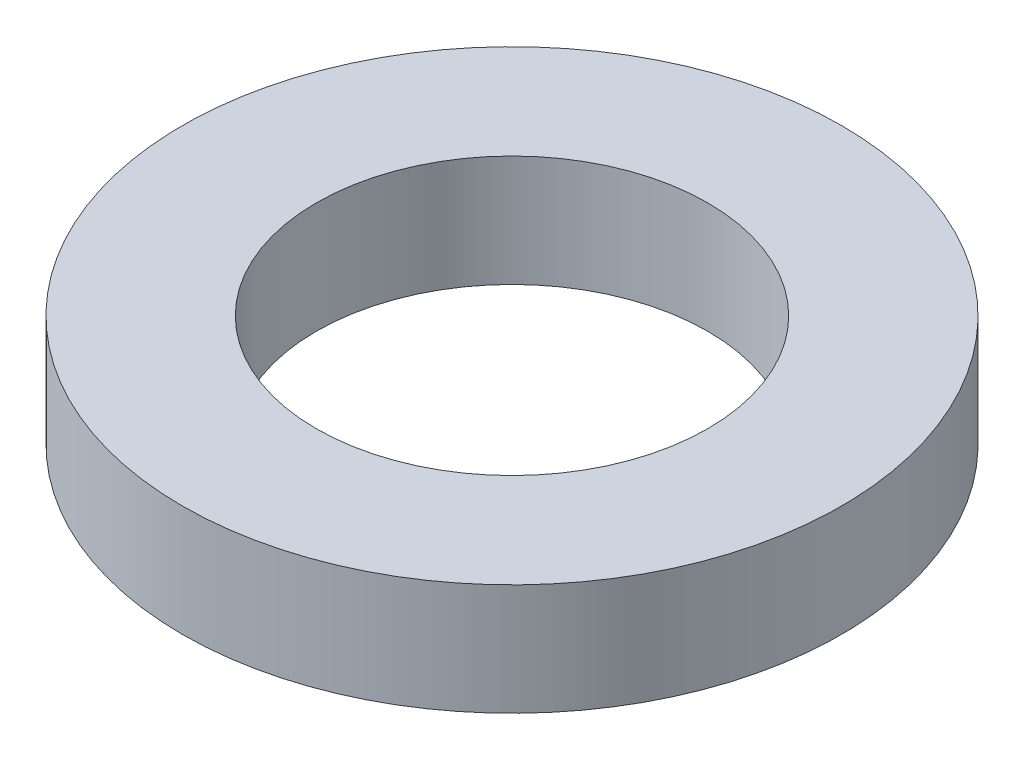
ISO-10303-21;
HEADER;
FILE_DESCRIPTION(('STEP AP214'),'2;1');
FILE_NAME('part.step','',(''),(''),'','','');
FILE_SCHEMA(('AUTOMOTIVE_DESIGN { 1 0 10303 214 1 1 1 1 }'));
ENDSEC;
DATA;
#1=APPLICATION_CONTEXT('core data for automotive mechanical design processes');
#2=APPLICATION_PROTOCOL_DEFINITION('international standard','automotive_design',2000,#1);
#3=PRODUCT_CONTEXT('',#1,'mechanical');
#4=PRODUCT('Part','Part','',(#3));
#5=PRODUCT_RELATED_PRODUCT_CATEGORY('part','',(#4));
#6=PRODUCT_DEFINITION_FORMATION('','',#4);
#7=PRODUCT_DEFINITION_CONTEXT('part definition',#1,'design');
#8=PRODUCT_DEFINITION('design','',#6,#7);
#9=PRODUCT_DEFINITION_SHAPE('','',#8);
#10=(LENGTH_UNIT() NAMED_UNIT(*) SI_UNIT(.MILLI.,.METRE.));
#11=(NAMED_UNIT(*) PLANE_ANGLE_UNIT() SI_UNIT($,.RADIAN.));
#12=(NAMED_UNIT(*) SI_UNIT($,.STERADIAN.) SOLID_ANGLE_UNIT());
#13=UNCERTAINTY_MEASURE_WITH_UNIT(LENGTH_MEASURE(1.E-05),#10,'distance_accuracy_value','');
#14=(GEOMETRIC_REPRESENTATION_CONTEXT(3) GLOBAL_UNCERTAINTY_ASSIGNED_CONTEXT((#13)) GLOBAL_UNIT_ASSIGNED_CONTEXT((#10,
#11,#12)) REPRESENTATION_CONTEXT('',''));
#15=CARTESIAN_POINT('',(0.,0.,0.));
#16=DIRECTION('',(0.,0.,1.));
#17=DIRECTION('',(1.,0.,0.));
#18=AXIS2_PLACEMENT_3D('',#15,#16,#17);
#19=CARTESIAN_POINT('',(0.,27.,0.));
#20=DIRECTION('',(0.,-1.,0.));
#21=DIRECTION('',(0.,0.,-1.));
#22=AXIS2_PLACEMENT_3D('',#19,#20,#21);
#23=CYLINDRICAL_SURFACE('',#22,80.);
#24=CARTESIAN_POINT('',(0.,27.,0.));
#25=DIRECTION('',(0.,1.,0.));
#26=DIRECTION('',(0.,0.,1.));
#27=AXIS2_PLACEMENT_3D('',#24,#25,#26);
#28=CIRCLE('',#27,80.);
#29=CARTESIAN_POINT('',(0.,27.,80.));
#30=VERTEX_POINT('',#29);
#31=EDGE_CURVE('E10',#30,#30,#28,.T.);
#32=ORIENTED_EDGE('',*,*,#31,.F.);
#33=EDGE_LOOP('',(#32));
#34=FACE_BOUND('',#33,.T.);
#35=CARTESIAN_POINT('',(0.,0.,0.));
#36=DIRECTION('',(0.,1.,0.));
#37=DIRECTION('',(0.,0.,1.));
#38=AXIS2_PLACEMENT_3D('',#35,#36,#37);
#39=CIRCLE('',#38,80.);
#40=CARTESIAN_POINT('',(0.,0.,80.));
#41=VERTEX_POINT('',#40);
#42=EDGE_CURVE('E37',#41,#41,#39,.T.);
#43=ORIENTED_EDGE('',*,*,#42,.T.);
#44=EDGE_LOOP('',(#43));
#45=FACE_BOUND('',#44,.T.);
#46=ADVANCED_FACE('F40',(#34,#45),#23,.T.);
#47=CARTESIAN_POINT('',(0.,27.,0.));
#48=DIRECTION('',(0.,1.,0.));
#49=DIRECTION('',(0.,0.,1.));
#50=AXIS2_PLACEMENT_3D('',#47,#48,#49);
#51=PLANE('',#50);
#52=CARTESIAN_POINT('',(0.,27.,0.));
#53=DIRECTION('',(0.,1.,0.));
#54=DIRECTION('',(0.,0.,1.));
#55=AXIS2_PLACEMENT_3D('',#52,#53,#54);
#56=CIRCLE('',#55,47.5);
#57=CARTESIAN_POINT('',(0.,27.,47.5));
#58=VERTEX_POINT('',#57);
#59=EDGE_CURVE('E50',#58,#58,#56,.T.);
#60=ORIENTED_EDGE('',*,*,#59,.F.);
#61=EDGE_LOOP('',(#60));
#62=FACE_BOUND('',#61,.T.);
#63=ORIENTED_EDGE('',*,*,#31,.T.);
#64=EDGE_LOOP('',(#63));
#65=FACE_BOUND('',#64,.T.);
#66=ADVANCED_FACE('F59',(#62,#65),#51,.T.);
#67=CARTESIAN_POINT('',(0.,0.,0.));
#68=DIRECTION('',(0.,1.,0.));
#69=DIRECTION('',(0.,0.,1.));
#70=AXIS2_PLACEMENT_3D('',#67,#68,#69);
#71=PLANE('',#70);
#72=CARTESIAN_POINT('',(0.,0.,0.));
#73=DIRECTION('',(0.,1.,0.));
#74=DIRECTION('',(0.,0.,1.));
#75=AXIS2_PLACEMENT_3D('',#72,#73,#74);
#76=CIRCLE('',#75,47.5);
#77=CARTESIAN_POINT('',(0.,0.,47.5));
#78=VERTEX_POINT('',#77);
#79=EDGE_CURVE('E47',#78,#78,#76,.T.);
#80=ORIENTED_EDGE('',*,*,#79,.T.);
#81=EDGE_LOOP('',(#80));
#82=FACE_BOUND('',#81,.T.);
#83=ORIENTED_EDGE('',*,*,#42,.F.);
#84=EDGE_LOOP('',(#83));
#85=FACE_BOUND('',#84,.T.);
#86=ADVANCED_FACE('F58',(#82,#85),#71,.F.);
#87=CARTESIAN_POINT('',(0.,27.,0.));
#88=DIRECTION('',(0.,-1.,0.));
#89=DIRECTION('',(0.,0.,-1.));
#90=AXIS2_PLACEMENT_3D('',#87,#88,#89);
#91=CYLINDRICAL_SURFACE('',#90,47.5);
#92=ORIENTED_EDGE('',*,*,#59,.T.);
#93=EDGE_LOOP('',(#92));
#94=FACE_BOUND('',#93,.T.);
#95=ORIENTED_EDGE('',*,*,#79,.F.);
#96=EDGE_LOOP('',(#95));
#97=FACE_BOUND('',#96,.T.);
#98=ADVANCED_FACE('F54',(#94,#97),#91,.F.);
#99=CLOSED_SHELL('',(#46,#66,#86,#98));
#100=MANIFOLD_SOLID_BREP('B2',#99);
#101=ADVANCED_BREP_SHAPE_REPRESENTATION('',(#18,#100),#14);
#102=SHAPE_DEFINITION_REPRESENTATION(#9,#101);
ENDSEC;
END-ISO-10303-21;
